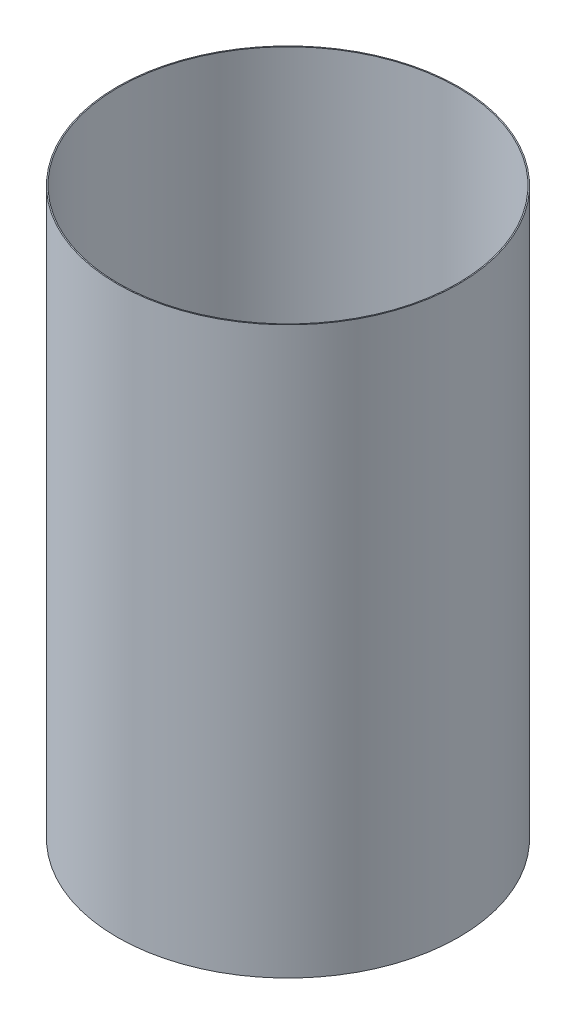
ISO-10303-21;
HEADER;
FILE_DESCRIPTION(('STEP AP214'),'2;1');
FILE_NAME('part.step','',(''),(''),'','','');
FILE_SCHEMA(('AUTOMOTIVE_DESIGN { 1 0 10303 214 1 1 1 1 }'));
ENDSEC;
DATA;
#1=APPLICATION_CONTEXT('core data for automotive mechanical design processes');
#2=APPLICATION_PROTOCOL_DEFINITION('international standard','automotive_design',2000,#1);
#3=PRODUCT_CONTEXT('',#1,'mechanical');
#4=PRODUCT('Part','Part','',(#3));
#5=PRODUCT_RELATED_PRODUCT_CATEGORY('part','',(#4));
#6=PRODUCT_DEFINITION_FORMATION('','',#4);
#7=PRODUCT_DEFINITION_CONTEXT('part definition',#1,'design');
#8=PRODUCT_DEFINITION('design','',#6,#7);
#9=PRODUCT_DEFINITION_SHAPE('','',#8);
#10=(LENGTH_UNIT() NAMED_UNIT(*) SI_UNIT(.MILLI.,.METRE.));
#11=(NAMED_UNIT(*) PLANE_ANGLE_UNIT() SI_UNIT($,.RADIAN.));
#12=(NAMED_UNIT(*) SI_UNIT($,.STERADIAN.) SOLID_ANGLE_UNIT());
#13=UNCERTAINTY_MEASURE_WITH_UNIT(LENGTH_MEASURE(1.E-05),#10,'distance_accuracy_value','');
#14=(GEOMETRIC_REPRESENTATION_CONTEXT(3) GLOBAL_UNCERTAINTY_ASSIGNED_CONTEXT((#13)) GLOBAL_UNIT_ASSIGNED_CONTEXT((#10,
#11,#12)) REPRESENTATION_CONTEXT('',''));
#15=CARTESIAN_POINT('',(0.,0.,0.));
#16=DIRECTION('',(0.,0.,1.));
#17=DIRECTION('',(1.,0.,0.));
#18=AXIS2_PLACEMENT_3D('',#15,#16,#17);
#19=CARTESIAN_POINT('',(0.,55.,0.));
#20=DIRECTION('',(0.,1.,0.));
#21=DIRECTION('',(0.,0.,1.));
#22=AXIS2_PLACEMENT_3D('',#19,#20,#21);
#23=CYLINDRICAL_SURFACE('',#22,40.259);
#24=CARTESIAN_POINT('',(0.,-202.353193409573,0.));
#25=DIRECTION('',(0.,1.,0.));
#26=DIRECTION('',(0.,0.,1.));
#27=AXIS2_PLACEMENT_3D('',#24,#25,#26);
#28=CIRCLE('',#27,40.259);
#29=CARTESIAN_POINT('',(0.,-202.353193409573,40.259));
#30=VERTEX_POINT('',#29);
#31=EDGE_CURVE('E45',#30,#30,#28,.T.);
#32=ORIENTED_EDGE('',*,*,#31,.T.);
#33=EDGE_LOOP('',(#32));
#34=FACE_BOUND('',#33,.T.);
#35=CARTESIAN_POINT('',(0.,-69.0031934095732,0.));
#36=DIRECTION('',(0.,1.,0.));
#37=DIRECTION('',(0.,0.,1.));
#38=AXIS2_PLACEMENT_3D('',#35,#36,#37);
#39=CIRCLE('',#38,40.259);
#40=CARTESIAN_POINT('',(0.,-69.0031934095732,40.259));
#41=VERTEX_POINT('',#40);
#42=EDGE_CURVE('E10',#41,#41,#39,.T.);
#43=ORIENTED_EDGE('',*,*,#42,.F.);
#44=EDGE_LOOP('',(#43));
#45=FACE_BOUND('',#44,.T.);
#46=ADVANCED_FACE('F31',(#34,#45),#23,.T.);
#47=CARTESIAN_POINT('',(-40.259,-69.0031934095732,0.));
#48=DIRECTION('',(0.,-1.,0.));
#49=DIRECTION('',(0.,0.,-1.));
#50=AXIS2_PLACEMENT_3D('',#47,#48,#49);
#51=PLANE('',#50);
#52=CARTESIAN_POINT('',(0.,-69.0031934095732,0.));
#53=DIRECTION('',(0.,1.,0.));
#54=DIRECTION('',(0.,0.,1.));
#55=AXIS2_PLACEMENT_3D('',#52,#53,#54);
#56=CIRCLE('',#55,40.005);
#57=CARTESIAN_POINT('',(0.,-69.0031934095732,40.005));
#58=VERTEX_POINT('',#57);
#59=EDGE_CURVE('E37',#58,#58,#56,.T.);
#60=ORIENTED_EDGE('',*,*,#59,.F.);
#61=EDGE_LOOP('',(#60));
#62=FACE_BOUND('',#61,.T.);
#63=ORIENTED_EDGE('',*,*,#42,.T.);
#64=EDGE_LOOP('',(#63));
#65=FACE_BOUND('',#64,.T.);
#66=ADVANCED_FACE('F61',(#62,#65),#51,.F.);
#67=CARTESIAN_POINT('',(0.,55.,0.));
#68=DIRECTION('',(0.,1.,0.));
#69=DIRECTION('',(0.,0.,1.));
#70=AXIS2_PLACEMENT_3D('',#67,#68,#69);
#71=CYLINDRICAL_SURFACE('',#70,40.005);
#72=CARTESIAN_POINT('',(0.,-202.353193409573,0.));
#73=DIRECTION('',(0.,1.,0.));
#74=DIRECTION('',(0.,0.,1.));
#75=AXIS2_PLACEMENT_3D('',#72,#73,#74);
#76=CIRCLE('',#75,40.005);
#77=CARTESIAN_POINT('',(0.,-202.353193409573,40.005));
#78=VERTEX_POINT('',#77);
#79=EDGE_CURVE('E41',#78,#78,#76,.T.);
#80=ORIENTED_EDGE('',*,*,#79,.F.);
#81=EDGE_LOOP('',(#80));
#82=FACE_BOUND('',#81,.T.);
#83=ORIENTED_EDGE('',*,*,#59,.T.);
#84=EDGE_LOOP('',(#83));
#85=FACE_BOUND('',#84,.T.);
#86=ADVANCED_FACE('F56',(#82,#85),#71,.F.);
#87=CARTESIAN_POINT('',(-40.005,-202.353193409573,0.));
#88=DIRECTION('',(0.,1.,0.));
#89=DIRECTION('',(0.,0.,1.));
#90=AXIS2_PLACEMENT_3D('',#87,#88,#89);
#91=PLANE('',#90);
#92=ORIENTED_EDGE('',*,*,#31,.F.);
#93=EDGE_LOOP('',(#92));
#94=FACE_BOUND('',#93,.T.);
#95=ORIENTED_EDGE('',*,*,#79,.T.);
#96=EDGE_LOOP('',(#95));
#97=FACE_BOUND('',#96,.T.);
#98=ADVANCED_FACE('F53',(#94,#97),#91,.F.);
#99=CLOSED_SHELL('',(#46,#66,#86,#98));
#100=MANIFOLD_SOLID_BREP('B2',#99);
#101=ADVANCED_BREP_SHAPE_REPRESENTATION('',(#18,#100),#14);
#102=SHAPE_DEFINITION_REPRESENTATION(#9,#101);
ENDSEC;
END-ISO-10303-21;
